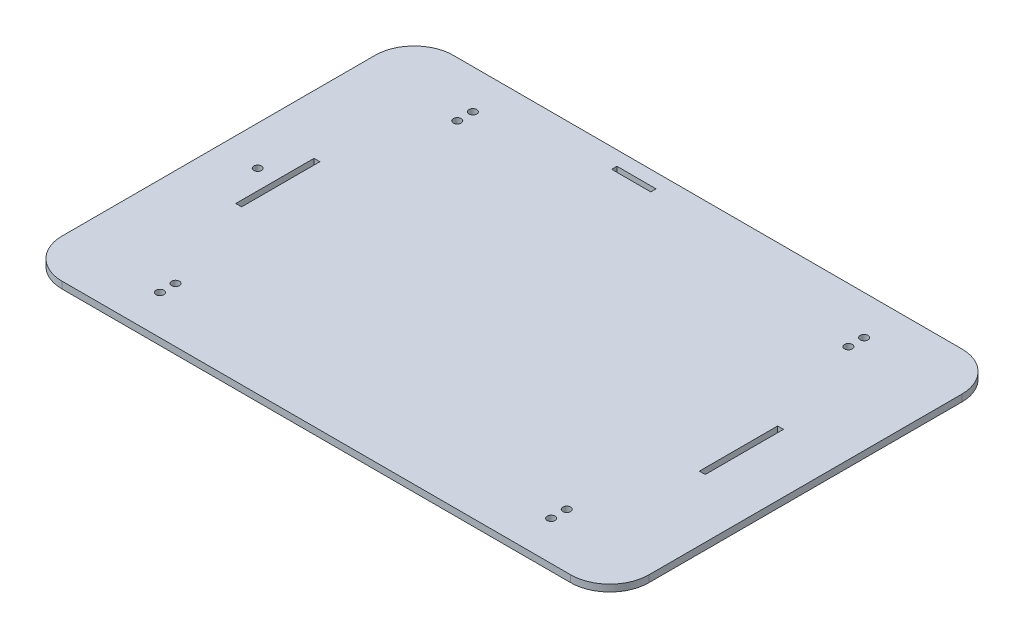
ISO-10303-21;
HEADER;
FILE_DESCRIPTION(('STEP AP214'),'2;1');
FILE_NAME('part.step','',(''),(''),'','','');
FILE_SCHEMA(('AUTOMOTIVE_DESIGN { 1 0 10303 214 1 1 1 1 }'));
ENDSEC;
DATA;
#1=APPLICATION_CONTEXT('core data for automotive mechanical design processes');
#2=APPLICATION_PROTOCOL_DEFINITION('international standard','automotive_design',2000,#1);
#3=PRODUCT_CONTEXT('',#1,'mechanical');
#4=PRODUCT('Part','Part','',(#3));
#5=PRODUCT_RELATED_PRODUCT_CATEGORY('part','',(#4));
#6=PRODUCT_DEFINITION_FORMATION('','',#4);
#7=PRODUCT_DEFINITION_CONTEXT('part definition',#1,'design');
#8=PRODUCT_DEFINITION('design','',#6,#7);
#9=PRODUCT_DEFINITION_SHAPE('','',#8);
#10=(LENGTH_UNIT() NAMED_UNIT(*) SI_UNIT(.MILLI.,.METRE.));
#11=(NAMED_UNIT(*) PLANE_ANGLE_UNIT() SI_UNIT($,.RADIAN.));
#12=(NAMED_UNIT(*) SI_UNIT($,.STERADIAN.) SOLID_ANGLE_UNIT());
#13=UNCERTAINTY_MEASURE_WITH_UNIT(LENGTH_MEASURE(1.E-05),#10,'distance_accuracy_value','');
#14=(GEOMETRIC_REPRESENTATION_CONTEXT(3) GLOBAL_UNCERTAINTY_ASSIGNED_CONTEXT((#13)) GLOBAL_UNIT_ASSIGNED_CONTEXT((#10,
#11,#12)) REPRESENTATION_CONTEXT('',''));
#15=CARTESIAN_POINT('',(0.,0.,0.));
#16=DIRECTION('',(0.,0.,1.));
#17=DIRECTION('',(1.,0.,0.));
#18=AXIS2_PLACEMENT_3D('',#15,#16,#17);
#19=CARTESIAN_POINT('',(130.,3.5,-80.));
#20=DIRECTION('',(0.,1.,0.));
#21=DIRECTION('',(0.,0.,1.));
#22=AXIS2_PLACEMENT_3D('',#19,#20,#21);
#23=PLANE('',#22);
#24=DIRECTION('',(0.,0.,-1.));
#25=VECTOR('',#24,1.);
#26=CARTESIAN_POINT('',(-19.0502011820644,3.5,-92.698971111264));
#27=LINE('',#26,#25);
#28=CARTESIAN_POINT('',(-19.0502011820644,3.5,-90.));
#29=VERTEX_POINT('',#28);
#30=CARTESIAN_POINT('',(-19.0502011820644,3.5,-92.698971111264));
#31=VERTEX_POINT('',#30);
#32=EDGE_CURVE('E49',#29,#31,#27,.T.);
#33=ORIENTED_EDGE('',*,*,#32,.F.);
#34=DIRECTION('',(1.,0.,0.));
#35=VECTOR('',#34,1.);
#36=CARTESIAN_POINT('',(-39.0502011820644,3.5,-90.));
#37=LINE('',#36,#35);
#38=CARTESIAN_POINT('',(-39.0502011820644,3.5,-90.));
#39=VERTEX_POINT('',#38);
#40=EDGE_CURVE('E243',#39,#29,#37,.T.);
#41=ORIENTED_EDGE('',*,*,#40,.F.);
#42=DIRECTION('',(0.,0.,1.));
#43=VECTOR('',#42,1.);
#44=CARTESIAN_POINT('',(-39.0502011820644,3.5,-92.698971111264));
#45=LINE('',#44,#43);
#46=CARTESIAN_POINT('',(-39.0502011820644,3.5,-92.698971111264));
#47=VERTEX_POINT('',#46);
#48=EDGE_CURVE('E240',#47,#39,#45,.T.);
#49=ORIENTED_EDGE('',*,*,#48,.F.);
#50=DIRECTION('',(-1.,0.,0.));
#51=VECTOR('',#50,1.);
#52=CARTESIAN_POINT('',(-39.0502011820644,3.5,-92.698971111264));
#53=LINE('',#52,#51);
#54=EDGE_CURVE('E237',#31,#47,#53,.T.);
#55=ORIENTED_EDGE('',*,*,#54,.F.);
#56=EDGE_LOOP('',(#33,#41,#49,#55));
#57=FACE_BOUND('',#56,.T.);
#58=CARTESIAN_POINT('',(100.,3.5,-72.));
#59=DIRECTION('',(0.,1.,0.));
#60=DIRECTION('',(0.,0.,-1.));
#61=AXIS2_PLACEMENT_3D('',#58,#59,#60);
#62=CIRCLE('',#61,2.);
#63=CARTESIAN_POINT('',(100.,3.5,-74.));
#64=VERTEX_POINT('',#63);
#65=EDGE_CURVE('E232',#64,#64,#62,.T.);
#66=ORIENTED_EDGE('',*,*,#65,.F.);
#67=EDGE_LOOP('',(#66));
#68=FACE_BOUND('',#67,.T.);
#69=CARTESIAN_POINT('',(100.,3.5,72.));
#70=DIRECTION('',(0.,1.,0.));
#71=DIRECTION('',(0.,0.,1.));
#72=AXIS2_PLACEMENT_3D('',#69,#70,#71);
#73=CIRCLE('',#72,2.);
#74=CARTESIAN_POINT('',(100.,3.5,74.));
#75=VERTEX_POINT('',#74);
#76=EDGE_CURVE('E214',#75,#75,#73,.T.);
#77=ORIENTED_EDGE('',*,*,#76,.F.);
#78=EDGE_LOOP('',(#77));
#79=FACE_BOUND('',#78,.T.);
#80=DIRECTION('',(0.,0.,-1.));
#81=VECTOR('',#80,1.);
#82=CARTESIAN_POINT('',(120.,3.5,-18.7859026437445));
#83=LINE('',#82,#81);
#84=CARTESIAN_POINT('',(120.,3.5,21.2140973562555));
#85=VERTEX_POINT('',#84);
#86=CARTESIAN_POINT('',(120.,3.5,-18.7859026437445));
#87=VERTEX_POINT('',#86);
#88=EDGE_CURVE('E57',#85,#87,#83,.T.);
#89=ORIENTED_EDGE('',*,*,#88,.F.);
#90=DIRECTION('',(1.,0.,0.));
#91=VECTOR('',#90,1.);
#92=CARTESIAN_POINT('',(120.,3.5,21.2140973562555));
#93=LINE('',#92,#91);
#94=CARTESIAN_POINT('',(117.,3.5,21.2140973562555));
#95=VERTEX_POINT('',#94);
#96=EDGE_CURVE('E220',#95,#85,#93,.T.);
#97=ORIENTED_EDGE('',*,*,#96,.F.);
#98=DIRECTION('',(0.,0.,1.));
#99=VECTOR('',#98,1.);
#100=CARTESIAN_POINT('',(117.,3.5,21.2140973562555));
#101=LINE('',#100,#99);
#102=CARTESIAN_POINT('',(117.,3.5,-18.7859026437445));
#103=VERTEX_POINT('',#102);
#104=EDGE_CURVE('E217',#103,#95,#101,.T.);
#105=ORIENTED_EDGE('',*,*,#104,.F.);
#106=DIRECTION('',(-1.,0.,0.));
#107=VECTOR('',#106,1.);
#108=CARTESIAN_POINT('',(117.,3.5,-18.7859026437445));
#109=LINE('',#108,#107);
#110=EDGE_CURVE('E213',#87,#103,#109,.T.);
#111=ORIENTED_EDGE('',*,*,#110,.F.);
#112=EDGE_LOOP('',(#89,#97,#105,#111));
#113=FACE_BOUND('',#112,.T.);
#114=CARTESIAN_POINT('',(-100.,3.5,72.));
#115=DIRECTION('',(0.,1.,0.));
#116=DIRECTION('',(0.,0.,-1.));
#117=AXIS2_PLACEMENT_3D('',#114,#115,#116);
#118=CIRCLE('',#117,2.);
#119=CARTESIAN_POINT('',(-100.,3.5,70.));
#120=VERTEX_POINT('',#119);
#121=EDGE_CURVE('E208',#120,#120,#118,.T.);
#122=ORIENTED_EDGE('',*,*,#121,.F.);
#123=EDGE_LOOP('',(#122));
#124=FACE_BOUND('',#123,.T.);
#125=DIRECTION('',(-1.,0.,0.));
#126=VECTOR('',#125,1.);
#127=CARTESIAN_POINT('',(-117.,3.5,-18.7859026437445));
#128=LINE('',#127,#126);
#129=CARTESIAN_POINT('',(-117.,3.5,-18.7859026437445));
#130=VERTEX_POINT('',#129);
#131=CARTESIAN_POINT('',(-120.,3.5,-18.7859026437445));
#132=VERTEX_POINT('',#131);
#133=EDGE_CURVE('E194',#130,#132,#128,.T.);
#134=ORIENTED_EDGE('',*,*,#133,.F.);
#135=DIRECTION('',(0.,0.,-1.));
#136=VECTOR('',#135,1.);
#137=CARTESIAN_POINT('',(-117.,3.5,21.2140973562555));
#138=LINE('',#137,#136);
#139=CARTESIAN_POINT('',(-117.,3.5,21.2140973562555));
#140=VERTEX_POINT('',#139);
#141=EDGE_CURVE('E198',#140,#130,#138,.T.);
#142=ORIENTED_EDGE('',*,*,#141,.F.);
#143=DIRECTION('',(1.,0.,0.));
#144=VECTOR('',#143,1.);
#145=CARTESIAN_POINT('',(-120.,3.5,21.2140973562555));
#146=LINE('',#145,#144);
#147=CARTESIAN_POINT('',(-120.,3.5,21.2140973562555));
#148=VERTEX_POINT('',#147);
#149=EDGE_CURVE('E178',#148,#140,#146,.T.);
#150=ORIENTED_EDGE('',*,*,#149,.F.);
#151=DIRECTION('',(0.,0.,1.));
#152=VECTOR('',#151,1.);
#153=CARTESIAN_POINT('',(-120.,3.5,-18.7859026437445));
#154=LINE('',#153,#152);
#155=EDGE_CURVE('E189',#132,#148,#154,.T.);
#156=ORIENTED_EDGE('',*,*,#155,.F.);
#157=EDGE_LOOP('',(#134,#142,#150,#156));
#158=FACE_BOUND('',#157,.T.);
#159=CARTESIAN_POINT('',(-100.,3.5,-72.));
#160=DIRECTION('',(0.,1.,0.));
#161=DIRECTION('',(0.,0.,1.));
#162=AXIS2_PLACEMENT_3D('',#159,#160,#161);
#163=CIRCLE('',#162,2.);
#164=CARTESIAN_POINT('',(-100.,3.5,-70.));
#165=VERTEX_POINT('',#164);
#166=EDGE_CURVE('E205',#165,#165,#163,.T.);
#167=ORIENTED_EDGE('',*,*,#166,.F.);
#168=EDGE_LOOP('',(#167));
#169=FACE_BOUND('',#168,.T.);
#170=CARTESIAN_POINT('',(-100.,3.5,80.));
#171=DIRECTION('',(0.,1.,0.));
#172=DIRECTION('',(0.,0.,1.));
#173=AXIS2_PLACEMENT_3D('',#170,#171,#172);
#174=CIRCLE('',#173,2.);
#175=CARTESIAN_POINT('',(-100.,3.5,82.));
#176=VERTEX_POINT('',#175);
#177=EDGE_CURVE('E264',#176,#176,#174,.T.);
#178=ORIENTED_EDGE('',*,*,#177,.F.);
#179=EDGE_LOOP('',(#178));
#180=FACE_BOUND('',#179,.T.);
#181=CARTESIAN_POINT('',(100.,3.5,-80.));
#182=DIRECTION('',(0.,1.,0.));
#183=DIRECTION('',(0.,0.,1.));
#184=AXIS2_PLACEMENT_3D('',#181,#182,#183);
#185=CIRCLE('',#184,2.);
#186=CARTESIAN_POINT('',(100.,3.5,-78.));
#187=VERTEX_POINT('',#186);
#188=EDGE_CURVE('E276',#187,#187,#185,.T.);
#189=ORIENTED_EDGE('',*,*,#188,.F.);
#190=EDGE_LOOP('',(#189));
#191=FACE_BOUND('',#190,.T.);
#192=CARTESIAN_POINT('',(130.,3.5,-80.));
#193=DIRECTION('',(0.,1.,0.));
#194=DIRECTION('',(0.,0.,1.));
#195=AXIS2_PLACEMENT_3D('',#192,#193,#194);
#196=CIRCLE('',#195,20.);
#197=CARTESIAN_POINT('',(150.,3.5,-80.));
#198=VERTEX_POINT('',#197);
#199=CARTESIAN_POINT('',(130.,3.5,-100.));
#200=VERTEX_POINT('',#199);
#201=EDGE_CURVE('E288',#198,#200,#196,.T.);
#202=ORIENTED_EDGE('',*,*,#201,.T.);
#203=DIRECTION('',(-1.,0.,0.));
#204=VECTOR('',#203,1.);
#205=CARTESIAN_POINT('',(130.,3.5,-100.));
#206=LINE('',#205,#204);
#207=CARTESIAN_POINT('',(-130.,3.5,-100.));
#208=VERTEX_POINT('',#207);
#209=EDGE_CURVE('E291',#200,#208,#206,.T.);
#210=ORIENTED_EDGE('',*,*,#209,.T.);
#211=CARTESIAN_POINT('',(-130.,3.5,-80.));
#212=DIRECTION('',(0.,1.,0.));
#213=DIRECTION('',(0.,0.,1.));
#214=AXIS2_PLACEMENT_3D('',#211,#212,#213);
#215=CIRCLE('',#214,20.);
#216=CARTESIAN_POINT('',(-150.,3.5,-80.));
#217=VERTEX_POINT('',#216);
#218=EDGE_CURVE('E294',#208,#217,#215,.T.);
#219=ORIENTED_EDGE('',*,*,#218,.T.);
#220=DIRECTION('',(0.,0.,1.));
#221=VECTOR('',#220,1.);
#222=CARTESIAN_POINT('',(-150.,3.5,80.));
#223=LINE('',#222,#221);
#224=CARTESIAN_POINT('',(-150.,3.5,80.));
#225=VERTEX_POINT('',#224);
#226=EDGE_CURVE('E296',#217,#225,#223,.T.);
#227=ORIENTED_EDGE('',*,*,#226,.T.);
#228=CARTESIAN_POINT('',(-130.,3.5,80.));
#229=DIRECTION('',(0.,1.,0.));
#230=DIRECTION('',(0.,0.,-1.));
#231=AXIS2_PLACEMENT_3D('',#228,#229,#230);
#232=CIRCLE('',#231,20.);
#233=CARTESIAN_POINT('',(-130.,3.5,100.));
#234=VERTEX_POINT('',#233);
#235=EDGE_CURVE('E298',#225,#234,#232,.T.);
#236=ORIENTED_EDGE('',*,*,#235,.T.);
#237=DIRECTION('',(1.,0.,0.));
#238=VECTOR('',#237,1.);
#239=CARTESIAN_POINT('',(130.,3.5,100.));
#240=LINE('',#239,#238);
#241=CARTESIAN_POINT('',(130.,3.5,100.));
#242=VERTEX_POINT('',#241);
#243=EDGE_CURVE('E300',#234,#242,#240,.T.);
#244=ORIENTED_EDGE('',*,*,#243,.T.);
#245=CARTESIAN_POINT('',(130.,3.5,80.));
#246=DIRECTION('',(0.,1.,0.));
#247=DIRECTION('',(0.,0.,1.));
#248=AXIS2_PLACEMENT_3D('',#245,#246,#247);
#249=CIRCLE('',#248,20.);
#250=CARTESIAN_POINT('',(150.,3.5,80.));
#251=VERTEX_POINT('',#250);
#252=EDGE_CURVE('E302',#242,#251,#249,.T.);
#253=ORIENTED_EDGE('',*,*,#252,.T.);
#254=DIRECTION('',(0.,0.,-1.));
#255=VECTOR('',#254,1.);
#256=CARTESIAN_POINT('',(150.,3.5,80.));
#257=LINE('',#256,#255);
#258=EDGE_CURVE('E304',#251,#198,#257,.T.);
#259=ORIENTED_EDGE('',*,*,#258,.T.);
#260=EDGE_LOOP('',(#202,#210,#219,#227,#236,#244,#253,#259));
#261=FACE_BOUND('',#260,.T.);
#262=CARTESIAN_POINT('',(-100.,3.5,-80.));
#263=DIRECTION('',(0.,1.,0.));
#264=DIRECTION('',(0.,0.,1.));
#265=AXIS2_PLACEMENT_3D('',#262,#263,#264);
#266=CIRCLE('',#265,2.);
#267=CARTESIAN_POINT('',(-100.,3.5,-78.));
#268=VERTEX_POINT('',#267);
#269=EDGE_CURVE('E282',#268,#268,#266,.T.);
#270=ORIENTED_EDGE('',*,*,#269,.F.);
#271=EDGE_LOOP('',(#270));
#272=FACE_BOUND('',#271,.T.);
#273=CARTESIAN_POINT('',(100.,3.5,80.));
#274=DIRECTION('',(0.,1.,0.));
#275=DIRECTION('',(0.,0.,1.));
#276=AXIS2_PLACEMENT_3D('',#273,#274,#275);
#277=CIRCLE('',#276,2.);
#278=CARTESIAN_POINT('',(100.,3.5,82.));
#279=VERTEX_POINT('',#278);
#280=EDGE_CURVE('E270',#279,#279,#277,.T.);
#281=ORIENTED_EDGE('',*,*,#280,.F.);
#282=EDGE_LOOP('',(#281));
#283=FACE_BOUND('',#282,.T.);
#284=CARTESIAN_POINT('',(-130.,3.5,0.));
#285=DIRECTION('',(0.,1.,0.));
#286=DIRECTION('',(0.,0.,1.));
#287=AXIS2_PLACEMENT_3D('',#284,#285,#286);
#288=CIRCLE('',#287,2.);
#289=CARTESIAN_POINT('',(-130.,3.5,2.));
#290=VERTEX_POINT('',#289);
#291=EDGE_CURVE('E256',#290,#290,#288,.T.);
#292=ORIENTED_EDGE('',*,*,#291,.F.);
#293=EDGE_LOOP('',(#292));
#294=FACE_BOUND('',#293,.T.);
#295=ADVANCED_FACE('F34',(#57,#68,#79,#113,#124,#158,#169,#180,#191,#261,#272,#283,#294),#23,.T.);
#296=CARTESIAN_POINT('',(130.,0.,-80.));
#297=DIRECTION('',(0.,1.,0.));
#298=DIRECTION('',(0.,0.,1.));
#299=AXIS2_PLACEMENT_3D('',#296,#297,#298);
#300=PLANE('',#299);
#301=DIRECTION('',(1.,0.,0.));
#302=VECTOR('',#301,1.);
#303=CARTESIAN_POINT('',(130.,0.,-90.));
#304=LINE('',#303,#302);
#305=CARTESIAN_POINT('',(-39.0502011820644,0.,-90.));
#306=VERTEX_POINT('',#305);
#307=CARTESIAN_POINT('',(-19.0502011820644,0.,-90.));
#308=VERTEX_POINT('',#307);
#309=EDGE_CURVE('E42',#306,#308,#304,.T.);
#310=ORIENTED_EDGE('',*,*,#309,.T.);
#311=DIRECTION('',(0.,0.,-1.));
#312=VECTOR('',#311,1.);
#313=CARTESIAN_POINT('',(-19.0502011820644,0.,-80.0000000000004));
#314=LINE('',#313,#312);
#315=CARTESIAN_POINT('',(-19.0502011820644,0.,-92.698971111264));
#316=VERTEX_POINT('',#315);
#317=EDGE_CURVE('E11',#308,#316,#314,.T.);
#318=ORIENTED_EDGE('',*,*,#317,.T.);
#319=DIRECTION('',(-1.,0.,0.));
#320=VECTOR('',#319,1.);
#321=CARTESIAN_POINT('',(130.,0.,-92.698971111264));
#322=LINE('',#321,#320);
#323=CARTESIAN_POINT('',(-39.0502011820644,0.,-92.698971111264));
#324=VERTEX_POINT('',#323);
#325=EDGE_CURVE('E372',#316,#324,#322,.T.);
#326=ORIENTED_EDGE('',*,*,#325,.T.);
#327=DIRECTION('',(0.,0.,1.));
#328=VECTOR('',#327,1.);
#329=CARTESIAN_POINT('',(-39.0502011820644,0.,-80.));
#330=LINE('',#329,#328);
#331=EDGE_CURVE('E379',#324,#306,#330,.T.);
#332=ORIENTED_EDGE('',*,*,#331,.T.);
#333=EDGE_LOOP('',(#310,#318,#326,#332));
#334=FACE_BOUND('',#333,.T.);
#335=CARTESIAN_POINT('',(100.,0.,-72.));
#336=DIRECTION('',(0.,1.,0.));
#337=DIRECTION('',(0.,0.,1.));
#338=AXIS2_PLACEMENT_3D('',#335,#336,#337);
#339=CIRCLE('',#338,2.);
#340=CARTESIAN_POINT('',(100.,0.,-70.));
#341=VERTEX_POINT('',#340);
#342=EDGE_CURVE('E263',#341,#341,#339,.T.);
#343=ORIENTED_EDGE('',*,*,#342,.T.);
#344=EDGE_LOOP('',(#343));
#345=FACE_BOUND('',#344,.T.);
#346=CARTESIAN_POINT('',(100.,0.,72.));
#347=DIRECTION('',(0.,1.,0.));
#348=DIRECTION('',(0.,0.,1.));
#349=AXIS2_PLACEMENT_3D('',#346,#347,#348);
#350=CIRCLE('',#349,2.);
#351=CARTESIAN_POINT('',(100.,0.,74.));
#352=VERTEX_POINT('',#351);
#353=EDGE_CURVE('E360',#352,#352,#350,.T.);
#354=ORIENTED_EDGE('',*,*,#353,.T.);
#355=EDGE_LOOP('',(#354));
#356=FACE_BOUND('',#355,.T.);
#357=DIRECTION('',(1.,0.,0.));
#358=VECTOR('',#357,1.);
#359=CARTESIAN_POINT('',(130.,0.,21.2140973562555));
#360=LINE('',#359,#358);
#361=CARTESIAN_POINT('',(117.,0.,21.2140973562555));
#362=VERTEX_POINT('',#361);
#363=CARTESIAN_POINT('',(120.,0.,21.2140973562555));
#364=VERTEX_POINT('',#363);
#365=EDGE_CURVE('E366',#362,#364,#360,.T.);
#366=ORIENTED_EDGE('',*,*,#365,.T.);
#367=DIRECTION('',(0.,0.,-1.));
#368=VECTOR('',#367,1.);
#369=CARTESIAN_POINT('',(120.,0.,-80.));
#370=LINE('',#369,#368);
#371=CARTESIAN_POINT('',(120.,0.,-18.7859026437445));
#372=VERTEX_POINT('',#371);
#373=EDGE_CURVE('E369',#364,#372,#370,.T.);
#374=ORIENTED_EDGE('',*,*,#373,.T.);
#375=DIRECTION('',(-1.,0.,0.));
#376=VECTOR('',#375,1.);
#377=CARTESIAN_POINT('',(130.,0.,-18.7859026437445));
#378=LINE('',#377,#376);
#379=CARTESIAN_POINT('',(117.,0.,-18.7859026437445));
#380=VERTEX_POINT('',#379);
#381=EDGE_CURVE('E357',#372,#380,#378,.T.);
#382=ORIENTED_EDGE('',*,*,#381,.T.);
#383=DIRECTION('',(0.,0.,1.));
#384=VECTOR('',#383,1.);
#385=CARTESIAN_POINT('',(117.,0.,-80.));
#386=LINE('',#385,#384);
#387=EDGE_CURVE('E363',#380,#362,#386,.T.);
#388=ORIENTED_EDGE('',*,*,#387,.T.);
#389=EDGE_LOOP('',(#366,#374,#382,#388));
#390=FACE_BOUND('',#389,.T.);
#391=CARTESIAN_POINT('',(-100.,0.,72.));
#392=DIRECTION('',(0.,1.,0.));
#393=DIRECTION('',(0.,0.,1.));
#394=AXIS2_PLACEMENT_3D('',#391,#392,#393);
#395=CIRCLE('',#394,2.);
#396=CARTESIAN_POINT('',(-100.,0.,74.));
#397=VERTEX_POINT('',#396);
#398=EDGE_CURVE('E348',#397,#397,#395,.T.);
#399=ORIENTED_EDGE('',*,*,#398,.T.);
#400=EDGE_LOOP('',(#399));
#401=FACE_BOUND('',#400,.T.);
#402=DIRECTION('',(0.,0.,-1.));
#403=VECTOR('',#402,1.);
#404=CARTESIAN_POINT('',(-117.,0.,-79.9999999999999));
#405=LINE('',#404,#403);
#406=CARTESIAN_POINT('',(-117.,0.,21.2140973562555));
#407=VERTEX_POINT('',#406);
#408=CARTESIAN_POINT('',(-117.,0.,-18.7859026437445));
#409=VERTEX_POINT('',#408);
#410=EDGE_CURVE('E351',#407,#409,#405,.T.);
#411=ORIENTED_EDGE('',*,*,#410,.T.);
#412=DIRECTION('',(-1.,0.,0.));
#413=VECTOR('',#412,1.);
#414=CARTESIAN_POINT('',(130.,0.,-18.7859026437445));
#415=LINE('',#414,#413);
#416=CARTESIAN_POINT('',(-120.,0.,-18.7859026437445));
#417=VERTEX_POINT('',#416);
#418=EDGE_CURVE('E354',#409,#417,#415,.T.);
#419=ORIENTED_EDGE('',*,*,#418,.T.);
#420=DIRECTION('',(0.,0.,1.));
#421=VECTOR('',#420,1.);
#422=CARTESIAN_POINT('',(-120.,0.,-80.));
#423=LINE('',#422,#421);
#424=CARTESIAN_POINT('',(-120.,0.,21.2140973562555));
#425=VERTEX_POINT('',#424);
#426=EDGE_CURVE('E345',#417,#425,#423,.T.);
#427=ORIENTED_EDGE('',*,*,#426,.T.);
#428=DIRECTION('',(1.,0.,0.));
#429=VECTOR('',#428,1.);
#430=CARTESIAN_POINT('',(130.,0.,21.2140973562555));
#431=LINE('',#430,#429);
#432=EDGE_CURVE('E181',#425,#407,#431,.T.);
#433=ORIENTED_EDGE('',*,*,#432,.T.);
#434=EDGE_LOOP('',(#411,#419,#427,#433));
#435=FACE_BOUND('',#434,.T.);
#436=CARTESIAN_POINT('',(-100.,0.,-72.));
#437=DIRECTION('',(0.,1.,0.));
#438=DIRECTION('',(0.,0.,1.));
#439=AXIS2_PLACEMENT_3D('',#436,#437,#438);
#440=CIRCLE('',#439,2.);
#441=CARTESIAN_POINT('',(-100.,0.,-70.));
#442=VERTEX_POINT('',#441);
#443=EDGE_CURVE('E255',#442,#442,#440,.T.);
#444=ORIENTED_EDGE('',*,*,#443,.T.);
#445=EDGE_LOOP('',(#444));
#446=FACE_BOUND('',#445,.T.);
#447=CARTESIAN_POINT('',(130.,0.,-80.));
#448=DIRECTION('',(0.,1.,0.));
#449=DIRECTION('',(0.,0.,1.));
#450=AXIS2_PLACEMENT_3D('',#447,#448,#449);
#451=CIRCLE('',#450,20.);
#452=CARTESIAN_POINT('',(150.,0.,-80.));
#453=VERTEX_POINT('',#452);
#454=CARTESIAN_POINT('',(130.,0.,-100.));
#455=VERTEX_POINT('',#454);
#456=EDGE_CURVE('E285',#453,#455,#451,.T.);
#457=ORIENTED_EDGE('',*,*,#456,.F.);
#458=DIRECTION('',(0.,0.,-1.));
#459=VECTOR('',#458,1.);
#460=CARTESIAN_POINT('',(150.,0.,80.));
#461=LINE('',#460,#459);
#462=CARTESIAN_POINT('',(150.,0.,80.));
#463=VERTEX_POINT('',#462);
#464=EDGE_CURVE('E292',#463,#453,#461,.T.);
#465=ORIENTED_EDGE('',*,*,#464,.F.);
#466=CARTESIAN_POINT('',(130.,0.,80.));
#467=DIRECTION('',(0.,1.,0.));
#468=DIRECTION('',(0.,0.,1.));
#469=AXIS2_PLACEMENT_3D('',#466,#467,#468);
#470=CIRCLE('',#469,20.);
#471=CARTESIAN_POINT('',(130.,0.,100.));
#472=VERTEX_POINT('',#471);
#473=EDGE_CURVE('E319',#472,#463,#470,.T.);
#474=ORIENTED_EDGE('',*,*,#473,.F.);
#475=DIRECTION('',(1.,0.,0.));
#476=VECTOR('',#475,1.);
#477=CARTESIAN_POINT('',(130.,0.,100.));
#478=LINE('',#477,#476);
#479=CARTESIAN_POINT('',(-130.,0.,100.));
#480=VERTEX_POINT('',#479);
#481=EDGE_CURVE('E317',#480,#472,#478,.T.);
#482=ORIENTED_EDGE('',*,*,#481,.F.);
#483=CARTESIAN_POINT('',(-130.,0.,80.));
#484=DIRECTION('',(0.,1.,0.));
#485=DIRECTION('',(0.,0.,-1.));
#486=AXIS2_PLACEMENT_3D('',#483,#484,#485);
#487=CIRCLE('',#486,20.);
#488=CARTESIAN_POINT('',(-150.,0.,80.));
#489=VERTEX_POINT('',#488);
#490=EDGE_CURVE('E315',#489,#480,#487,.T.);
#491=ORIENTED_EDGE('',*,*,#490,.F.);
#492=DIRECTION('',(0.,0.,1.));
#493=VECTOR('',#492,1.);
#494=CARTESIAN_POINT('',(-150.,0.,80.));
#495=LINE('',#494,#493);
#496=CARTESIAN_POINT('',(-150.,0.,-80.));
#497=VERTEX_POINT('',#496);
#498=EDGE_CURVE('E313',#497,#489,#495,.T.);
#499=ORIENTED_EDGE('',*,*,#498,.F.);
#500=CARTESIAN_POINT('',(-130.,0.,-80.));
#501=DIRECTION('',(0.,1.,0.));
#502=DIRECTION('',(0.,0.,1.));
#503=AXIS2_PLACEMENT_3D('',#500,#501,#502);
#504=CIRCLE('',#503,20.);
#505=CARTESIAN_POINT('',(-130.,0.,-100.));
#506=VERTEX_POINT('',#505);
#507=EDGE_CURVE('E311',#506,#497,#504,.T.);
#508=ORIENTED_EDGE('',*,*,#507,.F.);
#509=DIRECTION('',(-1.,0.,0.));
#510=VECTOR('',#509,1.);
#511=CARTESIAN_POINT('',(130.,0.,-100.));
#512=LINE('',#511,#510);
#513=EDGE_CURVE('E309',#455,#506,#512,.T.);
#514=ORIENTED_EDGE('',*,*,#513,.F.);
#515=EDGE_LOOP('',(#457,#465,#474,#482,#491,#499,#508,#514));
#516=FACE_BOUND('',#515,.T.);
#517=CARTESIAN_POINT('',(-100.,0.,-80.));
#518=DIRECTION('',(0.,1.,0.));
#519=DIRECTION('',(0.,0.,1.));
#520=AXIS2_PLACEMENT_3D('',#517,#518,#519);
#521=CIRCLE('',#520,2.);
#522=CARTESIAN_POINT('',(-100.,0.,-78.));
#523=VERTEX_POINT('',#522);
#524=EDGE_CURVE('E279',#523,#523,#521,.T.);
#525=ORIENTED_EDGE('',*,*,#524,.T.);
#526=EDGE_LOOP('',(#525));
#527=FACE_BOUND('',#526,.T.);
#528=CARTESIAN_POINT('',(100.,0.,-80.));
#529=DIRECTION('',(0.,1.,0.));
#530=DIRECTION('',(0.,0.,1.));
#531=AXIS2_PLACEMENT_3D('',#528,#529,#530);
#532=CIRCLE('',#531,2.);
#533=CARTESIAN_POINT('',(100.,0.,-78.));
#534=VERTEX_POINT('',#533);
#535=EDGE_CURVE('E273',#534,#534,#532,.T.);
#536=ORIENTED_EDGE('',*,*,#535,.T.);
#537=EDGE_LOOP('',(#536));
#538=FACE_BOUND('',#537,.T.);
#539=CARTESIAN_POINT('',(100.,0.,80.));
#540=DIRECTION('',(0.,1.,0.));
#541=DIRECTION('',(0.,0.,1.));
#542=AXIS2_PLACEMENT_3D('',#539,#540,#541);
#543=CIRCLE('',#542,2.);
#544=CARTESIAN_POINT('',(100.,0.,82.));
#545=VERTEX_POINT('',#544);
#546=EDGE_CURVE('E267',#545,#545,#543,.T.);
#547=ORIENTED_EDGE('',*,*,#546,.T.);
#548=EDGE_LOOP('',(#547));
#549=FACE_BOUND('',#548,.T.);
#550=CARTESIAN_POINT('',(-100.,0.,80.));
#551=DIRECTION('',(0.,1.,0.));
#552=DIRECTION('',(0.,0.,1.));
#553=AXIS2_PLACEMENT_3D('',#550,#551,#552);
#554=CIRCLE('',#553,2.);
#555=CARTESIAN_POINT('',(-100.,0.,82.));
#556=VERTEX_POINT('',#555);
#557=EDGE_CURVE('E259',#556,#556,#554,.T.);
#558=ORIENTED_EDGE('',*,*,#557,.T.);
#559=EDGE_LOOP('',(#558));
#560=FACE_BOUND('',#559,.T.);
#561=CARTESIAN_POINT('',(-130.,0.,0.));
#562=DIRECTION('',(0.,1.,0.));
#563=DIRECTION('',(0.,0.,1.));
#564=AXIS2_PLACEMENT_3D('',#561,#562,#563);
#565=CIRCLE('',#564,2.);
#566=CARTESIAN_POINT('',(-130.,0.,2.));
#567=VERTEX_POINT('',#566);
#568=EDGE_CURVE('E260',#567,#567,#565,.T.);
#569=ORIENTED_EDGE('',*,*,#568,.T.);
#570=EDGE_LOOP('',(#569));
#571=FACE_BOUND('',#570,.T.);
#572=ADVANCED_FACE('F383',(#334,#345,#356,#390,#401,#435,#446,#516,#527,#538,#549,#560,#571),
#300,.F.);
#573=CARTESIAN_POINT('',(130.,3.5,-80.));
#574=DIRECTION('',(0.,-1.,0.));
#575=DIRECTION('',(0.,0.,-1.));
#576=AXIS2_PLACEMENT_3D('',#573,#574,#575);
#577=CYLINDRICAL_SURFACE('',#576,20.);
#578=ORIENTED_EDGE('',*,*,#456,.T.);
#579=DIRECTION('',(0.,-1.,0.));
#580=VECTOR('',#579,1.);
#581=CARTESIAN_POINT('',(130.,3.5,-100.));
#582=LINE('',#581,#580);
#583=EDGE_CURVE('E342',#200,#455,#582,.T.);
#584=ORIENTED_EDGE('',*,*,#583,.F.);
#585=ORIENTED_EDGE('',*,*,#201,.F.);
#586=DIRECTION('',(0.,-1.,0.));
#587=VECTOR('',#586,1.);
#588=CARTESIAN_POINT('',(150.,3.5,-80.));
#589=LINE('',#588,#587);
#590=EDGE_CURVE('E306',#198,#453,#589,.T.);
#591=ORIENTED_EDGE('',*,*,#590,.T.);
#592=EDGE_LOOP('',(#578,#584,#585,#591));
#593=FACE_BOUND('',#592,.T.);
#594=ADVANCED_FACE('F36',(#593),#577,.T.);
#595=CARTESIAN_POINT('',(130.,3.5,-100.));
#596=DIRECTION('',(0.,0.,1.));
#597=DIRECTION('',(1.,0.,0.));
#598=AXIS2_PLACEMENT_3D('',#595,#596,#597);
#599=PLANE('',#598);
#600=ORIENTED_EDGE('',*,*,#513,.T.);
#601=DIRECTION('',(0.,-1.,0.));
#602=VECTOR('',#601,1.);
#603=CARTESIAN_POINT('',(-130.,3.5,-100.));
#604=LINE('',#603,#602);
#605=EDGE_CURVE('E339',#208,#506,#604,.T.);
#606=ORIENTED_EDGE('',*,*,#605,.F.);
#607=ORIENTED_EDGE('',*,*,#209,.F.);
#608=ORIENTED_EDGE('',*,*,#583,.T.);
#609=EDGE_LOOP('',(#600,#606,#607,#608));
#610=FACE_BOUND('',#609,.T.);
#611=ADVANCED_FACE('F445',(#610),#599,.F.);
#612=CARTESIAN_POINT('',(-130.,3.5,-80.));
#613=DIRECTION('',(0.,-1.,0.));
#614=DIRECTION('',(0.,0.,-1.));
#615=AXIS2_PLACEMENT_3D('',#612,#613,#614);
#616=CYLINDRICAL_SURFACE('',#615,20.);
#617=ORIENTED_EDGE('',*,*,#507,.T.);
#618=DIRECTION('',(0.,-1.,0.));
#619=VECTOR('',#618,1.);
#620=CARTESIAN_POINT('',(-150.,3.5,-80.));
#621=LINE('',#620,#619);
#622=EDGE_CURVE('E336',#217,#497,#621,.T.);
#623=ORIENTED_EDGE('',*,*,#622,.F.);
#624=ORIENTED_EDGE('',*,*,#218,.F.);
#625=ORIENTED_EDGE('',*,*,#605,.T.);
#626=EDGE_LOOP('',(#617,#623,#624,#625));
#627=FACE_BOUND('',#626,.T.);
#628=ADVANCED_FACE('F442',(#627),#616,.T.);
#629=CARTESIAN_POINT('',(-150.,3.5,80.));
#630=DIRECTION('',(1.,0.,0.));
#631=DIRECTION('',(0.,0.,-1.));
#632=AXIS2_PLACEMENT_3D('',#629,#630,#631);
#633=PLANE('',#632);
#634=ORIENTED_EDGE('',*,*,#498,.T.);
#635=DIRECTION('',(0.,-1.,0.));
#636=VECTOR('',#635,1.);
#637=CARTESIAN_POINT('',(-150.,3.5,80.));
#638=LINE('',#637,#636);
#639=EDGE_CURVE('E333',#225,#489,#638,.T.);
#640=ORIENTED_EDGE('',*,*,#639,.F.);
#641=ORIENTED_EDGE('',*,*,#226,.F.);
#642=ORIENTED_EDGE('',*,*,#622,.T.);
#643=EDGE_LOOP('',(#634,#640,#641,#642));
#644=FACE_BOUND('',#643,.T.);
#645=ADVANCED_FACE('F438',(#644),#633,.F.);
#646=CARTESIAN_POINT('',(-130.,3.5,80.));
#647=DIRECTION('',(0.,-1.,0.));
#648=DIRECTION('',(0.,0.,-1.));
#649=AXIS2_PLACEMENT_3D('',#646,#647,#648);
#650=CYLINDRICAL_SURFACE('',#649,20.);
#651=ORIENTED_EDGE('',*,*,#490,.T.);
#652=DIRECTION('',(0.,-1.,0.));
#653=VECTOR('',#652,1.);
#654=CARTESIAN_POINT('',(-130.,3.5,100.));
#655=LINE('',#654,#653);
#656=EDGE_CURVE('E330',#234,#480,#655,.T.);
#657=ORIENTED_EDGE('',*,*,#656,.F.);
#658=ORIENTED_EDGE('',*,*,#235,.F.);
#659=ORIENTED_EDGE('',*,*,#639,.T.);
#660=EDGE_LOOP('',(#651,#657,#658,#659));
#661=FACE_BOUND('',#660,.T.);
#662=ADVANCED_FACE('F434',(#661),#650,.T.);
#663=CARTESIAN_POINT('',(130.,3.5,100.));
#664=DIRECTION('',(0.,0.,-1.));
#665=DIRECTION('',(-1.,0.,0.));
#666=AXIS2_PLACEMENT_3D('',#663,#664,#665);
#667=PLANE('',#666);
#668=ORIENTED_EDGE('',*,*,#481,.T.);
#669=DIRECTION('',(0.,-1.,0.));
#670=VECTOR('',#669,1.);
#671=CARTESIAN_POINT('',(130.,3.5,100.));
#672=LINE('',#671,#670);
#673=EDGE_CURVE('E327',#242,#472,#672,.T.);
#674=ORIENTED_EDGE('',*,*,#673,.F.);
#675=ORIENTED_EDGE('',*,*,#243,.F.);
#676=ORIENTED_EDGE('',*,*,#656,.T.);
#677=EDGE_LOOP('',(#668,#674,#675,#676));
#678=FACE_BOUND('',#677,.T.);
#679=ADVANCED_FACE('F430',(#678),#667,.F.);
#680=CARTESIAN_POINT('',(130.,3.5,80.));
#681=DIRECTION('',(0.,-1.,0.));
#682=DIRECTION('',(0.,0.,-1.));
#683=AXIS2_PLACEMENT_3D('',#680,#681,#682);
#684=CYLINDRICAL_SURFACE('',#683,20.);
#685=ORIENTED_EDGE('',*,*,#473,.T.);
#686=DIRECTION('',(0.,-1.,0.));
#687=VECTOR('',#686,1.);
#688=CARTESIAN_POINT('',(150.,3.5,80.));
#689=LINE('',#688,#687);
#690=EDGE_CURVE('E324',#251,#463,#689,.T.);
#691=ORIENTED_EDGE('',*,*,#690,.F.);
#692=ORIENTED_EDGE('',*,*,#252,.F.);
#693=ORIENTED_EDGE('',*,*,#673,.T.);
#694=EDGE_LOOP('',(#685,#691,#692,#693));
#695=FACE_BOUND('',#694,.T.);
#696=ADVANCED_FACE('F426',(#695),#684,.T.);
#697=CARTESIAN_POINT('',(150.,3.5,80.));
#698=DIRECTION('',(-1.,0.,0.));
#699=DIRECTION('',(0.,0.,1.));
#700=AXIS2_PLACEMENT_3D('',#697,#698,#699);
#701=PLANE('',#700);
#702=ORIENTED_EDGE('',*,*,#464,.T.);
#703=ORIENTED_EDGE('',*,*,#590,.F.);
#704=ORIENTED_EDGE('',*,*,#258,.F.);
#705=ORIENTED_EDGE('',*,*,#690,.T.);
#706=EDGE_LOOP('',(#702,#703,#704,#705));
#707=FACE_BOUND('',#706,.T.);
#708=ADVANCED_FACE('F423',(#707),#701,.F.);
#709=CARTESIAN_POINT('',(-100.,3.5,-80.));
#710=DIRECTION('',(0.,-1.,0.));
#711=DIRECTION('',(0.,0.,-1.));
#712=AXIS2_PLACEMENT_3D('',#709,#710,#711);
#713=CYLINDRICAL_SURFACE('',#712,2.);
#714=ORIENTED_EDGE('',*,*,#269,.T.);
#715=EDGE_LOOP('',(#714));
#716=FACE_BOUND('',#715,.T.);
#717=ORIENTED_EDGE('',*,*,#524,.F.);
#718=EDGE_LOOP('',(#717));
#719=FACE_BOUND('',#718,.T.);
#720=ADVANCED_FACE('F420',(#716,#719),#713,.F.);
#721=CARTESIAN_POINT('',(100.,3.5,-80.));
#722=DIRECTION('',(0.,-1.,0.));
#723=DIRECTION('',(0.,0.,-1.));
#724=AXIS2_PLACEMENT_3D('',#721,#722,#723);
#725=CYLINDRICAL_SURFACE('',#724,2.);
#726=ORIENTED_EDGE('',*,*,#188,.T.);
#727=EDGE_LOOP('',(#726));
#728=FACE_BOUND('',#727,.T.);
#729=ORIENTED_EDGE('',*,*,#535,.F.);
#730=EDGE_LOOP('',(#729));
#731=FACE_BOUND('',#730,.T.);
#732=ADVANCED_FACE('F504',(#728,#731),#725,.F.);
#733=CARTESIAN_POINT('',(100.,3.5,80.));
#734=DIRECTION('',(0.,-1.,0.));
#735=DIRECTION('',(0.,0.,-1.));
#736=AXIS2_PLACEMENT_3D('',#733,#734,#735);
#737=CYLINDRICAL_SURFACE('',#736,2.);
#738=ORIENTED_EDGE('',*,*,#280,.T.);
#739=EDGE_LOOP('',(#738));
#740=FACE_BOUND('',#739,.T.);
#741=ORIENTED_EDGE('',*,*,#546,.F.);
#742=EDGE_LOOP('',(#741));
#743=FACE_BOUND('',#742,.T.);
#744=ADVANCED_FACE('F499',(#740,#743),#737,.F.);
#745=CARTESIAN_POINT('',(-100.,3.5,80.));
#746=DIRECTION('',(0.,-1.,0.));
#747=DIRECTION('',(0.,0.,-1.));
#748=AXIS2_PLACEMENT_3D('',#745,#746,#747);
#749=CYLINDRICAL_SURFACE('',#748,2.);
#750=ORIENTED_EDGE('',*,*,#177,.T.);
#751=EDGE_LOOP('',(#750));
#752=FACE_BOUND('',#751,.T.);
#753=ORIENTED_EDGE('',*,*,#557,.F.);
#754=EDGE_LOOP('',(#753));
#755=FACE_BOUND('',#754,.T.);
#756=ADVANCED_FACE('F489',(#752,#755),#749,.F.);
#757=CARTESIAN_POINT('',(-130.,3.5,0.));
#758=DIRECTION('',(0.,-1.,0.));
#759=DIRECTION('',(0.,0.,-1.));
#760=AXIS2_PLACEMENT_3D('',#757,#758,#759);
#761=CYLINDRICAL_SURFACE('',#760,2.);
#762=ORIENTED_EDGE('',*,*,#291,.T.);
#763=EDGE_LOOP('',(#762));
#764=FACE_BOUND('',#763,.T.);
#765=ORIENTED_EDGE('',*,*,#568,.F.);
#766=EDGE_LOOP('',(#765));
#767=FACE_BOUND('',#766,.T.);
#768=ADVANCED_FACE('F485',(#764,#767),#761,.F.);
#769=CARTESIAN_POINT('',(-100.,-6.5,-72.));
#770=DIRECTION('',(0.,1.,0.));
#771=DIRECTION('',(0.,0.,1.));
#772=AXIS2_PLACEMENT_3D('',#769,#770,#771);
#773=CYLINDRICAL_SURFACE('',#772,2.);
#774=ORIENTED_EDGE('',*,*,#166,.T.);
#775=EDGE_LOOP('',(#774));
#776=FACE_BOUND('',#775,.T.);
#777=ORIENTED_EDGE('',*,*,#443,.F.);
#778=EDGE_LOOP('',(#777));
#779=FACE_BOUND('',#778,.T.);
#780=ADVANCED_FACE('F488',(#776,#779),#773,.F.);
#781=CARTESIAN_POINT('',(-117.,-6.5,-18.7859026437445));
#782=DIRECTION('',(0.,0.,-1.));
#783=DIRECTION('',(-1.,0.,0.));
#784=AXIS2_PLACEMENT_3D('',#781,#782,#783);
#785=PLANE('',#784);
#786=DIRECTION('',(0.,1.,0.));
#787=VECTOR('',#786,1.);
#788=CARTESIAN_POINT('',(-117.,-6.5,-18.7859026437445));
#789=LINE('',#788,#787);
#790=EDGE_CURVE('E203',#409,#130,#789,.T.);
#791=ORIENTED_EDGE('',*,*,#790,.T.);
#792=ORIENTED_EDGE('',*,*,#133,.T.);
#793=DIRECTION('',(0.,1.,0.));
#794=VECTOR('',#793,1.);
#795=CARTESIAN_POINT('',(-120.,-6.5,-18.7859026437445));
#796=LINE('',#795,#794);
#797=EDGE_CURVE('E185',#417,#132,#796,.T.);
#798=ORIENTED_EDGE('',*,*,#797,.F.);
#799=ORIENTED_EDGE('',*,*,#418,.F.);
#800=EDGE_LOOP('',(#791,#792,#798,#799));
#801=FACE_BOUND('',#800,.T.);
#802=ADVANCED_FACE('F497',(#801),#785,.F.);
#803=CARTESIAN_POINT('',(-117.,-6.5,21.2140973562555));
#804=DIRECTION('',(1.,0.,0.));
#805=DIRECTION('',(0.,0.,-1.));
#806=AXIS2_PLACEMENT_3D('',#803,#804,#805);
#807=PLANE('',#806);
#808=DIRECTION('',(0.,1.,0.));
#809=VECTOR('',#808,1.);
#810=CARTESIAN_POINT('',(-117.,-6.5,21.2140973562555));
#811=LINE('',#810,#809);
#812=EDGE_CURVE('E184',#407,#140,#811,.T.);
#813=ORIENTED_EDGE('',*,*,#812,.T.);
#814=ORIENTED_EDGE('',*,*,#141,.T.);
#815=ORIENTED_EDGE('',*,*,#790,.F.);
#816=ORIENTED_EDGE('',*,*,#410,.F.);
#817=EDGE_LOOP('',(#813,#814,#815,#816));
#818=FACE_BOUND('',#817,.T.);
#819=ADVANCED_FACE('F585',(#818),#807,.F.);
#820=CARTESIAN_POINT('',(-120.,-6.5,21.2140973562555));
#821=DIRECTION('',(0.,0.,1.));
#822=DIRECTION('',(1.,0.,0.));
#823=AXIS2_PLACEMENT_3D('',#820,#821,#822);
#824=PLANE('',#823);
#825=DIRECTION('',(0.,1.,0.));
#826=VECTOR('',#825,1.);
#827=CARTESIAN_POINT('',(-120.,-6.5,21.2140973562555));
#828=LINE('',#827,#826);
#829=EDGE_CURVE('E173',#425,#148,#828,.T.);
#830=ORIENTED_EDGE('',*,*,#829,.T.);
#831=ORIENTED_EDGE('',*,*,#149,.T.);
#832=ORIENTED_EDGE('',*,*,#812,.F.);
#833=ORIENTED_EDGE('',*,*,#432,.F.);
#834=EDGE_LOOP('',(#830,#831,#832,#833));
#835=FACE_BOUND('',#834,.T.);
#836=ADVANCED_FACE('F175',(#835),#824,.F.);
#837=CARTESIAN_POINT('',(-120.,-6.5,-18.7859026437445));
#838=DIRECTION('',(-1.,0.,0.));
#839=DIRECTION('',(0.,0.,1.));
#840=AXIS2_PLACEMENT_3D('',#837,#838,#839);
#841=PLANE('',#840);
#842=ORIENTED_EDGE('',*,*,#797,.T.);
#843=ORIENTED_EDGE('',*,*,#155,.T.);
#844=ORIENTED_EDGE('',*,*,#829,.F.);
#845=ORIENTED_EDGE('',*,*,#426,.F.);
#846=EDGE_LOOP('',(#842,#843,#844,#845));
#847=FACE_BOUND('',#846,.T.);
#848=ADVANCED_FACE('F190',(#847),#841,.F.);
#849=CARTESIAN_POINT('',(-100.,-6.5,72.));
#850=DIRECTION('',(0.,1.,0.));
#851=DIRECTION('',(0.,0.,1.));
#852=AXIS2_PLACEMENT_3D('',#849,#850,#851);
#853=CYLINDRICAL_SURFACE('',#852,2.);
#854=ORIENTED_EDGE('',*,*,#121,.T.);
#855=EDGE_LOOP('',(#854));
#856=FACE_BOUND('',#855,.T.);
#857=ORIENTED_EDGE('',*,*,#398,.F.);
#858=EDGE_LOOP('',(#857));
#859=FACE_BOUND('',#858,.T.);
#860=ADVANCED_FACE('F612',(#856,#859),#853,.F.);
#861=CARTESIAN_POINT('',(120.,-6.5,-18.7859026437445));
#862=DIRECTION('',(1.,0.,0.));
#863=DIRECTION('',(0.,0.,-1.));
#864=AXIS2_PLACEMENT_3D('',#861,#862,#863);
#865=PLANE('',#864);
#866=DIRECTION('',(0.,1.,0.));
#867=VECTOR('',#866,1.);
#868=CARTESIAN_POINT('',(120.,-6.5,21.2140973562555));
#869=LINE('',#868,#867);
#870=EDGE_CURVE('E211',#364,#85,#869,.T.);
#871=ORIENTED_EDGE('',*,*,#870,.T.);
#872=ORIENTED_EDGE('',*,*,#88,.T.);
#873=DIRECTION('',(0.,1.,0.));
#874=VECTOR('',#873,1.);
#875=CARTESIAN_POINT('',(120.,-6.5,-18.7859026437445));
#876=LINE('',#875,#874);
#877=EDGE_CURVE('E223',#372,#87,#876,.T.);
#878=ORIENTED_EDGE('',*,*,#877,.F.);
#879=ORIENTED_EDGE('',*,*,#373,.F.);
#880=EDGE_LOOP('',(#871,#872,#878,#879));
#881=FACE_BOUND('',#880,.T.);
#882=ADVANCED_FACE('F621',(#881),#865,.F.);
#883=CARTESIAN_POINT('',(120.,-6.5,21.2140973562555));
#884=DIRECTION('',(0.,0.,1.));
#885=DIRECTION('',(1.,0.,0.));
#886=AXIS2_PLACEMENT_3D('',#883,#884,#885);
#887=PLANE('',#886);
#888=DIRECTION('',(0.,1.,0.));
#889=VECTOR('',#888,1.);
#890=CARTESIAN_POINT('',(117.,-6.5,21.2140973562555));
#891=LINE('',#890,#889);
#892=EDGE_CURVE('E225',#362,#95,#891,.T.);
#893=ORIENTED_EDGE('',*,*,#892,.T.);
#894=ORIENTED_EDGE('',*,*,#96,.T.);
#895=ORIENTED_EDGE('',*,*,#870,.F.);
#896=ORIENTED_EDGE('',*,*,#365,.F.);
#897=EDGE_LOOP('',(#893,#894,#895,#896));
#898=FACE_BOUND('',#897,.T.);
#899=ADVANCED_FACE('F631',(#898),#887,.F.);
#900=CARTESIAN_POINT('',(117.,-6.5,21.2140973562555));
#901=DIRECTION('',(-1.,0.,0.));
#902=DIRECTION('',(0.,0.,1.));
#903=AXIS2_PLACEMENT_3D('',#900,#901,#902);
#904=PLANE('',#903);
#905=DIRECTION('',(0.,1.,0.));
#906=VECTOR('',#905,1.);
#907=CARTESIAN_POINT('',(117.,-6.5,-18.7859026437445));
#908=LINE('',#907,#906);
#909=EDGE_CURVE('E227',#380,#103,#908,.T.);
#910=ORIENTED_EDGE('',*,*,#909,.T.);
#911=ORIENTED_EDGE('',*,*,#104,.T.);
#912=ORIENTED_EDGE('',*,*,#892,.F.);
#913=ORIENTED_EDGE('',*,*,#387,.F.);
#914=EDGE_LOOP('',(#910,#911,#912,#913));
#915=FACE_BOUND('',#914,.T.);
#916=ADVANCED_FACE('F640',(#915),#904,.F.);
#917=CARTESIAN_POINT('',(117.,-6.5,-18.7859026437445));
#918=DIRECTION('',(0.,0.,-1.));
#919=DIRECTION('',(-1.,0.,0.));
#920=AXIS2_PLACEMENT_3D('',#917,#918,#919);
#921=PLANE('',#920);
#922=ORIENTED_EDGE('',*,*,#877,.T.);
#923=ORIENTED_EDGE('',*,*,#110,.T.);
#924=ORIENTED_EDGE('',*,*,#909,.F.);
#925=ORIENTED_EDGE('',*,*,#381,.F.);
#926=EDGE_LOOP('',(#922,#923,#924,#925));
#927=FACE_BOUND('',#926,.T.);
#928=ADVANCED_FACE('F650',(#927),#921,.F.);
#929=CARTESIAN_POINT('',(100.,-6.5,72.));
#930=DIRECTION('',(0.,1.,0.));
#931=DIRECTION('',(0.,0.,1.));
#932=AXIS2_PLACEMENT_3D('',#929,#930,#931);
#933=CYLINDRICAL_SURFACE('',#932,2.);
#934=ORIENTED_EDGE('',*,*,#76,.T.);
#935=EDGE_LOOP('',(#934));
#936=FACE_BOUND('',#935,.T.);
#937=ORIENTED_EDGE('',*,*,#353,.F.);
#938=EDGE_LOOP('',(#937));
#939=FACE_BOUND('',#938,.T.);
#940=ADVANCED_FACE('F408',(#936,#939),#933,.F.);
#941=CARTESIAN_POINT('',(100.,-6.5,-72.));
#942=DIRECTION('',(0.,1.,0.));
#943=DIRECTION('',(0.,0.,1.));
#944=AXIS2_PLACEMENT_3D('',#941,#942,#943);
#945=CYLINDRICAL_SURFACE('',#944,2.);
#946=ORIENTED_EDGE('',*,*,#65,.T.);
#947=EDGE_LOOP('',(#946));
#948=FACE_BOUND('',#947,.T.);
#949=ORIENTED_EDGE('',*,*,#342,.F.);
#950=EDGE_LOOP('',(#949));
#951=FACE_BOUND('',#950,.T.);
#952=ADVANCED_FACE('F401',(#948,#951),#945,.F.);
#953=CARTESIAN_POINT('',(-19.0502011820644,-6.5,-92.698971111264));
#954=DIRECTION('',(1.,0.,0.));
#955=DIRECTION('',(0.,0.,-1.));
#956=AXIS2_PLACEMENT_3D('',#953,#954,#955);
#957=PLANE('',#956);
#958=DIRECTION('',(0.,1.,0.));
#959=VECTOR('',#958,1.);
#960=CARTESIAN_POINT('',(-19.0502011820644,-6.5,-90.));
#961=LINE('',#960,#959);
#962=EDGE_CURVE('E235',#308,#29,#961,.T.);
#963=ORIENTED_EDGE('',*,*,#962,.T.);
#964=ORIENTED_EDGE('',*,*,#32,.T.);
#965=DIRECTION('',(0.,1.,0.));
#966=VECTOR('',#965,1.);
#967=CARTESIAN_POINT('',(-19.0502011820644,-6.5,-92.698971111264));
#968=LINE('',#967,#966);
#969=EDGE_CURVE('E246',#316,#31,#968,.T.);
#970=ORIENTED_EDGE('',*,*,#969,.F.);
#971=ORIENTED_EDGE('',*,*,#317,.F.);
#972=EDGE_LOOP('',(#963,#964,#970,#971));
#973=FACE_BOUND('',#972,.T.);
#974=ADVANCED_FACE('F399',(#973),#957,.F.);
#975=CARTESIAN_POINT('',(-39.0502011820644,-6.5,-90.));
#976=DIRECTION('',(0.,0.,1.));
#977=DIRECTION('',(1.,0.,0.));
#978=AXIS2_PLACEMENT_3D('',#975,#976,#977);
#979=PLANE('',#978);
#980=DIRECTION('',(0.,1.,0.));
#981=VECTOR('',#980,1.);
#982=CARTESIAN_POINT('',(-39.0502011820644,-6.5,-90.));
#983=LINE('',#982,#981);
#984=EDGE_CURVE('E248',#306,#39,#983,.T.);
#985=ORIENTED_EDGE('',*,*,#984,.T.);
#986=ORIENTED_EDGE('',*,*,#40,.T.);
#987=ORIENTED_EDGE('',*,*,#962,.F.);
#988=ORIENTED_EDGE('',*,*,#309,.F.);
#989=EDGE_LOOP('',(#985,#986,#987,#988));
#990=FACE_BOUND('',#989,.T.);
#991=ADVANCED_FACE('F389',(#990),#979,.F.);
#992=CARTESIAN_POINT('',(-39.0502011820644,-6.5,-92.698971111264));
#993=DIRECTION('',(-1.,0.,0.));
#994=DIRECTION('',(0.,0.,1.));
#995=AXIS2_PLACEMENT_3D('',#992,#993,#994);
#996=PLANE('',#995);
#997=DIRECTION('',(0.,1.,0.));
#998=VECTOR('',#997,1.);
#999=CARTESIAN_POINT('',(-39.0502011820644,-6.5,-92.698971111264));
#1000=LINE('',#999,#998);
#1001=EDGE_CURVE('E250',#324,#47,#1000,.T.);
#1002=ORIENTED_EDGE('',*,*,#1001,.T.);
#1003=ORIENTED_EDGE('',*,*,#48,.T.);
#1004=ORIENTED_EDGE('',*,*,#984,.F.);
#1005=ORIENTED_EDGE('',*,*,#331,.F.);
#1006=EDGE_LOOP('',(#1002,#1003,#1004,#1005));
#1007=FACE_BOUND('',#1006,.T.);
#1008=ADVANCED_FACE('F391',(#1007),#996,.F.);
#1009=CARTESIAN_POINT('',(-39.0502011820644,-6.5,-92.698971111264));
#1010=DIRECTION('',(0.,0.,-1.));
#1011=DIRECTION('',(-1.,0.,0.));
#1012=AXIS2_PLACEMENT_3D('',#1009,#1010,#1011);
#1013=PLANE('',#1012);
#1014=ORIENTED_EDGE('',*,*,#969,.T.);
#1015=ORIENTED_EDGE('',*,*,#54,.T.);
#1016=ORIENTED_EDGE('',*,*,#1001,.F.);
#1017=ORIENTED_EDGE('',*,*,#325,.F.);
#1018=EDGE_LOOP('',(#1014,#1015,#1016,#1017));
#1019=FACE_BOUND('',#1018,.T.);
#1020=ADVANCED_FACE('F398',(#1019),#1013,.F.);
#1021=CLOSED_SHELL('',(#295,#572,#594,#611,#628,#645,#662,#679,#696,#708,#720,#732,#744,#756,
#768,#780,#802,#819,#836,#848,#860,#882,#899,#916,#928,#940,#952,#974,#991,#1008,#1020));
#1022=MANIFOLD_SOLID_BREP('B2',#1021);
#1023=ADVANCED_BREP_SHAPE_REPRESENTATION('',(#18,#1022),#14);
#1024=SHAPE_DEFINITION_REPRESENTATION(#9,#1023);
ENDSEC;
END-ISO-10303-21;
